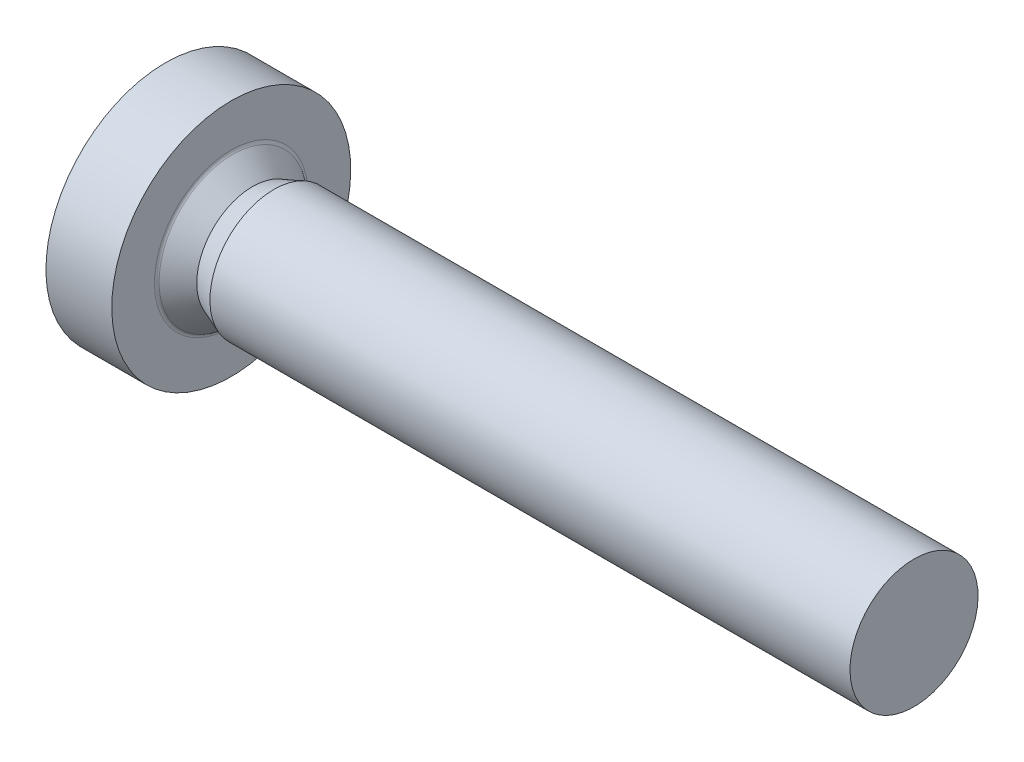
ISO-10303-21;
HEADER;
FILE_DESCRIPTION(('STEP AP214'),'2;1');
FILE_NAME('part.step','',(''),(''),'','','');
FILE_SCHEMA(('AUTOMOTIVE_DESIGN { 1 0 10303 214 1 1 1 1 }'));
ENDSEC;
DATA;
#1=APPLICATION_CONTEXT('core data for automotive mechanical design processes');
#2=APPLICATION_PROTOCOL_DEFINITION('international standard','automotive_design',2000,#1);
#3=PRODUCT_CONTEXT('',#1,'mechanical');
#4=PRODUCT('Part','Part','',(#3));
#5=PRODUCT_RELATED_PRODUCT_CATEGORY('part','',(#4));
#6=PRODUCT_DEFINITION_FORMATION('','',#4);
#7=PRODUCT_DEFINITION_CONTEXT('part definition',#1,'design');
#8=PRODUCT_DEFINITION('design','',#6,#7);
#9=PRODUCT_DEFINITION_SHAPE('','',#8);
#10=(LENGTH_UNIT() NAMED_UNIT(*) SI_UNIT(.MILLI.,.METRE.));
#11=(NAMED_UNIT(*) PLANE_ANGLE_UNIT() SI_UNIT($,.RADIAN.));
#12=(NAMED_UNIT(*) SI_UNIT($,.STERADIAN.) SOLID_ANGLE_UNIT());
#13=UNCERTAINTY_MEASURE_WITH_UNIT(LENGTH_MEASURE(1.E-05),#10,'distance_accuracy_value','');
#14=(GEOMETRIC_REPRESENTATION_CONTEXT(3) GLOBAL_UNCERTAINTY_ASSIGNED_CONTEXT((#13)) GLOBAL_UNIT_ASSIGNED_CONTEXT((#10,
#11,#12)) REPRESENTATION_CONTEXT('',''));
#15=CARTESIAN_POINT('',(0.,0.,0.));
#16=DIRECTION('',(0.,0.,1.));
#17=DIRECTION('',(1.,0.,0.));
#18=AXIS2_PLACEMENT_3D('',#15,#16,#17);
#19=CARTESIAN_POINT('',(16.,0.75,0.));
#20=DIRECTION('',(1.,0.,0.));
#21=DIRECTION('',(0.,1.,0.));
#22=AXIS2_PLACEMENT_3D('',#19,#20,#21);
#23=PLANE('',#22);
#24=CARTESIAN_POINT('',(16.,0.,0.));
#25=DIRECTION('',(1.,0.,0.));
#26=DIRECTION('',(0.,1.,0.));
#27=AXIS2_PLACEMENT_3D('',#24,#25,#26);
#28=CIRCLE('',#27,1.5);
#29=CARTESIAN_POINT('',(16.,1.5,0.));
#30=VERTEX_POINT('',#29);
#31=EDGE_CURVE('E11',#30,#30,#28,.T.);
#32=ORIENTED_EDGE('',*,*,#31,.T.);
#33=EDGE_LOOP('',(#32));
#34=FACE_BOUND('',#33,.T.);
#35=ADVANCED_FACE('F19',(#34),#23,.T.);
#36=CARTESIAN_POINT('',(8.5,0.,0.));
#37=DIRECTION('',(-1.,0.,0.));
#38=DIRECTION('',(0.,1.,0.));
#39=AXIS2_PLACEMENT_3D('',#36,#37,#38);
#40=CYLINDRICAL_SURFACE('',#39,1.5);
#41=CARTESIAN_POINT('',(1.,0.,0.));
#42=DIRECTION('',(1.,0.,0.));
#43=DIRECTION('',(0.,1.,0.));
#44=AXIS2_PLACEMENT_3D('',#41,#42,#43);
#45=CIRCLE('',#44,1.5);
#46=CARTESIAN_POINT('',(1.,1.5,0.));
#47=VERTEX_POINT('',#46);
#48=EDGE_CURVE('E29',#47,#47,#45,.T.);
#49=ORIENTED_EDGE('',*,*,#48,.T.);
#50=EDGE_LOOP('',(#49));
#51=FACE_BOUND('',#50,.T.);
#52=ORIENTED_EDGE('',*,*,#31,.F.);
#53=EDGE_LOOP('',(#52));
#54=FACE_BOUND('',#53,.T.);
#55=ADVANCED_FACE('F409',(#51,#54),#40,.T.);
#56=CARTESIAN_POINT('',(0.75,0.,0.));
#57=DIRECTION('',(1.,0.,0.));
#58=DIRECTION('',(0.,1.,0.));
#59=AXIS2_PLACEMENT_3D('',#56,#57,#58);
#60=CONICAL_SURFACE('',#59,1.404375,0.36532974538052);
#61=CARTESIAN_POINT('',(0.5,0.,0.));
#62=DIRECTION('',(1.,0.,0.));
#63=DIRECTION('',(0.,1.,0.));
#64=AXIS2_PLACEMENT_3D('',#61,#62,#63);
#65=CIRCLE('',#64,1.30875);
#66=CARTESIAN_POINT('',(0.5,1.30875,0.));
#67=VERTEX_POINT('',#66);
#68=EDGE_CURVE('E277',#67,#67,#65,.T.);
#69=ORIENTED_EDGE('',*,*,#68,.T.);
#70=EDGE_LOOP('',(#69));
#71=FACE_BOUND('',#70,.T.);
#72=ORIENTED_EDGE('',*,*,#48,.F.);
#73=EDGE_LOOP('',(#72));
#74=FACE_BOUND('',#73,.T.);
#75=ADVANCED_FACE('F414',(#71,#74),#60,.T.);
#76=CARTESIAN_POINT('',(0.266697090928547,0.,0.));
#77=DIRECTION('',(-1.,0.,0.));
#78=DIRECTION('',(0.,1.,0.));
#79=AXIS2_PLACEMENT_3D('',#76,#77,#78);
#80=CONICAL_SURFACE('',#79,1.51708001042528,0.728911585355214);
#81=CARTESIAN_POINT('',(0.0333941818570946,0.,0.));
#82=DIRECTION('',(1.,0.,0.));
#83=DIRECTION('',(0.,1.,0.));
#84=AXIS2_PLACEMENT_3D('',#81,#82,#83);
#85=CIRCLE('',#84,1.72541002085056);
#86=CARTESIAN_POINT('',(0.0333941818570951,1.72541002085056,0.));
#87=VERTEX_POINT('',#86);
#88=EDGE_CURVE('E275',#87,#87,#85,.T.);
#89=ORIENTED_EDGE('',*,*,#88,.T.);
#90=EDGE_LOOP('',(#89));
#91=FACE_BOUND('',#90,.T.);
#92=ORIENTED_EDGE('',*,*,#68,.F.);
#93=EDGE_LOOP('',(#92));
#94=FACE_BOUND('',#93,.T.);
#95=ADVANCED_FACE('F469',(#91,#94),#80,.T.);
#96=CARTESIAN_POINT('',(0.1,0.,0.));
#97=DIRECTION('',(1.,0.,0.));
#98=DIRECTION('',(0.,0.,-1.));
#99=AXIS2_PLACEMENT_3D('',#96,#97,#98);
#100=TOROIDAL_SURFACE('',#99,1.8,0.1);
#101=CARTESIAN_POINT('',(0.,0.,0.));
#102=DIRECTION('',(1.,0.,0.));
#103=DIRECTION('',(0.,1.,0.));
#104=AXIS2_PLACEMENT_3D('',#101,#102,#103);
#105=CIRCLE('',#104,1.8);
#106=CARTESIAN_POINT('',(0.,1.8,0.));
#107=VERTEX_POINT('',#106);
#108=EDGE_CURVE('E278',#107,#107,#105,.T.);
#109=ORIENTED_EDGE('',*,*,#108,.T.);
#110=EDGE_LOOP('',(#109));
#111=FACE_BOUND('',#110,.T.);
#112=ORIENTED_EDGE('',*,*,#88,.F.);
#113=EDGE_LOOP('',(#112));
#114=FACE_BOUND('',#113,.T.);
#115=ADVANCED_FACE('F446',(#111,#114),#100,.F.);
#116=CARTESIAN_POINT('',(0.,2.3,0.));
#117=DIRECTION('',(1.,0.,0.));
#118=DIRECTION('',(0.,1.,0.));
#119=AXIS2_PLACEMENT_3D('',#116,#117,#118);
#120=PLANE('',#119);
#121=CARTESIAN_POINT('',(0.,0.,0.));
#122=DIRECTION('',(1.,0.,0.));
#123=DIRECTION('',(0.,1.,0.));
#124=AXIS2_PLACEMENT_3D('',#121,#122,#123);
#125=CIRCLE('',#124,2.8);
#126=CARTESIAN_POINT('',(0.,2.8,0.));
#127=VERTEX_POINT('',#126);
#128=EDGE_CURVE('E286',#127,#127,#125,.T.);
#129=ORIENTED_EDGE('',*,*,#128,.T.);
#130=EDGE_LOOP('',(#129));
#131=FACE_BOUND('',#130,.T.);
#132=ORIENTED_EDGE('',*,*,#108,.F.);
#133=EDGE_LOOP('',(#132));
#134=FACE_BOUND('',#133,.T.);
#135=ADVANCED_FACE('F443',(#131,#134),#120,.T.);
#136=CARTESIAN_POINT('',(-0.771231517720798,0.,0.));
#137=DIRECTION('',(-1.,0.,0.));
#138=DIRECTION('',(0.,1.,0.));
#139=AXIS2_PLACEMENT_3D('',#136,#137,#138);
#140=CYLINDRICAL_SURFACE('',#139,2.8);
#141=CARTESIAN_POINT('',(-1.54246303544159,0.,0.));
#142=DIRECTION('',(1.,0.,0.));
#143=DIRECTION('',(0.,1.,0.));
#144=AXIS2_PLACEMENT_3D('',#141,#142,#143);
#145=CIRCLE('',#144,2.8);
#146=CARTESIAN_POINT('',(-1.54246303544159,2.8,0.));
#147=VERTEX_POINT('',#146);
#148=EDGE_CURVE('E284',#147,#147,#145,.T.);
#149=ORIENTED_EDGE('',*,*,#148,.T.);
#150=EDGE_LOOP('',(#149));
#151=FACE_BOUND('',#150,.T.);
#152=ORIENTED_EDGE('',*,*,#128,.F.);
#153=EDGE_LOOP('',(#152));
#154=FACE_BOUND('',#153,.T.);
#155=ADVANCED_FACE('F435',(#151,#154),#140,.T.);
#156=CARTESIAN_POINT('',(2.6,0.,0.));
#157=DIRECTION('',(0.,0.,1.));
#158=DIRECTION('',(1.,0.,0.));
#159=AXIS2_PLACEMENT_3D('',#156,#157,#158);
#160=SPHERICAL_SURFACE('',#159,5.);
#161=ORIENTED_EDGE('',*,*,#148,.F.);
#162=EDGE_LOOP('',(#161));
#163=FACE_BOUND('',#162,.T.);
#164=CARTESIAN_POINT('',(2.6,1.5,0.));
#165=DIRECTION('',(0.,1.,0.));
#166=DIRECTION('',(0.,0.,-1.));
#167=AXIS2_PLACEMENT_3D('',#164,#165,#166);
#168=CIRCLE('',#167,4.76969600708473);
#169=CARTESIAN_POINT('',(-2.16025209416476,1.5,-0.3));
#170=VERTEX_POINT('',#169);
#171=CARTESIAN_POINT('',(-2.16025209416476,1.5,0.3));
#172=VERTEX_POINT('',#171);
#173=EDGE_CURVE('E312',#170,#172,#168,.T.);
#174=ORIENTED_EDGE('',*,*,#173,.T.);
#175=CARTESIAN_POINT('',(2.6,-0.0146530414091956,0.167485029701634));
#176=DIRECTION('',(0.,-0.0871557427476582,0.996194698091746));
#177=DIRECTION('',(0.,0.996194698091746,0.0871557427476581));
#178=AXIS2_PLACEMENT_3D('',#175,#176,#177);
#179=CIRCLE('',#178,4.99717260590459);
#180=CARTESIAN_POINT('',(-2.35893576512593,0.6,0.221260202826669));
#181=VERTEX_POINT('',#180);
#182=EDGE_CURVE('E95',#172,#181,#179,.T.);
#183=ORIENTED_EDGE('',*,*,#182,.T.);
#184=CARTESIAN_POINT('',(2.6,0.245808478247197,0.425752773255334));
#185=DIRECTION('',(0.,0.5,0.866025403784438));
#186=DIRECTION('',(0.,0.866025403784438,-0.5));
#187=AXIS2_PLACEMENT_3D('',#184,#185,#186);
#188=CIRCLE('',#187,4.97577258002083);
#189=CARTESIAN_POINT('',(-2.374028589137,0.359888590016273,0.359888590016274));
#190=VERTEX_POINT('',#189);
#191=EDGE_CURVE('E281',#181,#190,#188,.T.);
#192=ORIENTED_EDGE('',*,*,#191,.T.);
#193=CARTESIAN_POINT('',(2.6,0.425752773255333,0.245808478247197));
#194=DIRECTION('',(0.,0.866025403784439,0.5));
#195=DIRECTION('',(0.,0.5,-0.866025403784439));
#196=AXIS2_PLACEMENT_3D('',#193,#194,#195);
#197=CIRCLE('',#196,4.97577258002083);
#198=CARTESIAN_POINT('',(-2.35893576512593,0.221260202826669,0.6));
#199=VERTEX_POINT('',#198);
#200=EDGE_CURVE('E200',#190,#199,#197,.T.);
#201=ORIENTED_EDGE('',*,*,#200,.T.);
#202=CARTESIAN_POINT('',(2.6,0.167485029701634,-0.0146530414091956));
#203=DIRECTION('',(0.,0.996194698091746,-0.0871557427476583));
#204=DIRECTION('',(0.,-0.0871557427476583,-0.996194698091746));
#205=AXIS2_PLACEMENT_3D('',#202,#203,#204);
#206=CIRCLE('',#205,4.99717260590459);
#207=CARTESIAN_POINT('',(-2.16025209416476,0.3,1.5));
#208=VERTEX_POINT('',#207);
#209=EDGE_CURVE('E206',#199,#208,#206,.T.);
#210=ORIENTED_EDGE('',*,*,#209,.T.);
#211=CARTESIAN_POINT('',(2.6,0.,1.5));
#212=DIRECTION('',(0.,0.,1.));
#213=DIRECTION('',(0.,1.,0.));
#214=AXIS2_PLACEMENT_3D('',#211,#212,#213);
#215=CIRCLE('',#214,4.76969600708473);
#216=CARTESIAN_POINT('',(-2.16025209416476,-0.3,1.5));
#217=VERTEX_POINT('',#216);
#218=EDGE_CURVE('E209',#208,#217,#215,.T.);
#219=ORIENTED_EDGE('',*,*,#218,.T.);
#220=CARTESIAN_POINT('',(2.6,-0.167485029701634,-0.0146530414091956));
#221=DIRECTION('',(0.,-0.996194698091746,-0.0871557427476581));
#222=DIRECTION('',(0.,-0.0871557427476581,0.996194698091746));
#223=AXIS2_PLACEMENT_3D('',#220,#221,#222);
#224=CIRCLE('',#223,4.99717260590459);
#225=CARTESIAN_POINT('',(-2.35893576512593,-0.221260202826669,0.6));
#226=VERTEX_POINT('',#225);
#227=EDGE_CURVE('E142',#217,#226,#224,.T.);
#228=ORIENTED_EDGE('',*,*,#227,.T.);
#229=CARTESIAN_POINT('',(2.6,-0.425752773255333,0.245808478247197));
#230=DIRECTION('',(0.,-0.866025403784439,0.5));
#231=DIRECTION('',(0.,0.5,0.866025403784439));
#232=AXIS2_PLACEMENT_3D('',#229,#230,#231);
#233=CIRCLE('',#232,4.97577258002083);
#234=CARTESIAN_POINT('',(-2.374028589137,-0.359888590016273,0.359888590016274));
#235=VERTEX_POINT('',#234);
#236=EDGE_CURVE('E258',#226,#235,#233,.T.);
#237=ORIENTED_EDGE('',*,*,#236,.T.);
#238=CARTESIAN_POINT('',(2.6,-0.245808478247197,0.425752773255334));
#239=DIRECTION('',(0.,-0.5,0.866025403784439));
#240=DIRECTION('',(0.,0.866025403784439,0.5));
#241=AXIS2_PLACEMENT_3D('',#238,#239,#240);
#242=CIRCLE('',#241,4.97577258002083);
#243=CARTESIAN_POINT('',(-2.35893576512593,-0.6,0.221260202826669));
#244=VERTEX_POINT('',#243);
#245=EDGE_CURVE('E254',#235,#244,#242,.T.);
#246=ORIENTED_EDGE('',*,*,#245,.T.);
#247=CARTESIAN_POINT('',(2.6,0.0146530414091956,0.167485029701634));
#248=DIRECTION('',(0.,0.0871557427476581,0.996194698091746));
#249=DIRECTION('',(0.,0.996194698091746,-0.0871557427476581));
#250=AXIS2_PLACEMENT_3D('',#247,#248,#249);
#251=CIRCLE('',#250,4.99717260590459);
#252=CARTESIAN_POINT('',(-2.16025209416476,-1.5,0.3));
#253=VERTEX_POINT('',#252);
#254=EDGE_CURVE('E266',#244,#253,#251,.T.);
#255=ORIENTED_EDGE('',*,*,#254,.T.);
#256=CARTESIAN_POINT('',(2.6,-1.5,0.));
#257=DIRECTION('',(0.,-1.,0.));
#258=DIRECTION('',(0.,0.,1.));
#259=AXIS2_PLACEMENT_3D('',#256,#257,#258);
#260=CIRCLE('',#259,4.76969600708473);
#261=CARTESIAN_POINT('',(-2.16025209416476,-1.5,-0.3));
#262=VERTEX_POINT('',#261);
#263=EDGE_CURVE('E330',#253,#262,#260,.T.);
#264=ORIENTED_EDGE('',*,*,#263,.T.);
#265=CARTESIAN_POINT('',(2.6,0.0146530414091956,-0.167485029701634));
#266=DIRECTION('',(0.,0.087155742747658,-0.996194698091746));
#267=DIRECTION('',(0.,-0.996194698091746,-0.087155742747658));
#268=AXIS2_PLACEMENT_3D('',#265,#266,#267);
#269=CIRCLE('',#268,4.99717260590459);
#270=CARTESIAN_POINT('',(-2.35893576512593,-0.6,-0.221260202826669));
#271=VERTEX_POINT('',#270);
#272=EDGE_CURVE('E263',#262,#271,#269,.T.);
#273=ORIENTED_EDGE('',*,*,#272,.T.);
#274=CARTESIAN_POINT('',(2.6,-0.245808478247196,-0.425752773255333));
#275=DIRECTION('',(0.,-0.5,-0.866025403784439));
#276=DIRECTION('',(0.,-0.866025403784439,0.5));
#277=AXIS2_PLACEMENT_3D('',#274,#275,#276);
#278=CIRCLE('',#277,4.97577258002083);
#279=CARTESIAN_POINT('',(-2.374028589137,-0.359888590016273,-0.359888590016273));
#280=VERTEX_POINT('',#279);
#281=EDGE_CURVE('E216',#271,#280,#278,.T.);
#282=ORIENTED_EDGE('',*,*,#281,.T.);
#283=CARTESIAN_POINT('',(2.6,-0.425752773255333,-0.245808478247196));
#284=DIRECTION('',(0.,-0.866025403784439,-0.5));
#285=DIRECTION('',(0.,-0.5,0.866025403784439));
#286=AXIS2_PLACEMENT_3D('',#283,#284,#285);
#287=CIRCLE('',#286,4.97577258002083);
#288=CARTESIAN_POINT('',(-2.35893576512593,-0.221260202826669,-0.6));
#289=VERTEX_POINT('',#288);
#290=EDGE_CURVE('E315',#280,#289,#287,.T.);
#291=ORIENTED_EDGE('',*,*,#290,.T.);
#292=CARTESIAN_POINT('',(2.6,-0.167485029701634,0.0146530414091956));
#293=DIRECTION('',(0.,-0.996194698091746,0.0871557427476582));
#294=DIRECTION('',(0.,0.0871557427476582,0.996194698091746));
#295=AXIS2_PLACEMENT_3D('',#292,#293,#294);
#296=CIRCLE('',#295,4.99717260590459);
#297=CARTESIAN_POINT('',(-2.16025209416476,-0.3,-1.5));
#298=VERTEX_POINT('',#297);
#299=EDGE_CURVE('E291',#289,#298,#296,.T.);
#300=ORIENTED_EDGE('',*,*,#299,.T.);
#301=CARTESIAN_POINT('',(2.6,0.,-1.5));
#302=DIRECTION('',(0.,0.,-1.));
#303=DIRECTION('',(0.,-1.,0.));
#304=AXIS2_PLACEMENT_3D('',#301,#302,#303);
#305=CIRCLE('',#304,4.76969600708473);
#306=CARTESIAN_POINT('',(-2.16025209416476,0.3,-1.5));
#307=VERTEX_POINT('',#306);
#308=EDGE_CURVE('E333',#298,#307,#305,.T.);
#309=ORIENTED_EDGE('',*,*,#308,.T.);
#310=CARTESIAN_POINT('',(2.6,0.167485029701634,0.0146530414091956));
#311=DIRECTION('',(0.,0.996194698091746,0.0871557427476582));
#312=DIRECTION('',(0.,0.0871557427476582,-0.996194698091746));
#313=AXIS2_PLACEMENT_3D('',#310,#311,#312);
#314=CIRCLE('',#313,4.99717260590459);
#315=CARTESIAN_POINT('',(-2.35893576512593,0.221260202826669,-0.6));
#316=VERTEX_POINT('',#315);
#317=EDGE_CURVE('E221',#307,#316,#314,.T.);
#318=ORIENTED_EDGE('',*,*,#317,.T.);
#319=CARTESIAN_POINT('',(2.6,0.425752773255333,-0.245808478247196));
#320=DIRECTION('',(0.,0.866025403784439,-0.5));
#321=DIRECTION('',(0.,-0.5,-0.866025403784439));
#322=AXIS2_PLACEMENT_3D('',#319,#320,#321);
#323=CIRCLE('',#322,4.97577258002083);
#324=CARTESIAN_POINT('',(-2.374028589137,0.359888590016273,-0.359888590016274));
#325=VERTEX_POINT('',#324);
#326=EDGE_CURVE('E67',#316,#325,#323,.T.);
#327=ORIENTED_EDGE('',*,*,#326,.T.);
#328=CARTESIAN_POINT('',(2.6,0.245808478247196,-0.425752773255333));
#329=DIRECTION('',(0.,0.5,-0.866025403784439));
#330=DIRECTION('',(0.,-0.866025403784439,-0.5));
#331=AXIS2_PLACEMENT_3D('',#328,#329,#330);
#332=CIRCLE('',#331,4.97577258002083);
#333=CARTESIAN_POINT('',(-2.35893576512593,0.6,-0.221260202826669));
#334=VERTEX_POINT('',#333);
#335=EDGE_CURVE('E240',#325,#334,#332,.T.);
#336=ORIENTED_EDGE('',*,*,#335,.T.);
#337=CARTESIAN_POINT('',(2.6,-0.0146530414091956,-0.167485029701633));
#338=DIRECTION('',(0.,-0.0871557427476582,-0.996194698091746));
#339=DIRECTION('',(0.,-0.996194698091746,0.0871557427476582));
#340=AXIS2_PLACEMENT_3D('',#337,#338,#339);
#341=CIRCLE('',#340,4.99717260590459);
#342=EDGE_CURVE('E225',#334,#170,#341,.T.);
#343=ORIENTED_EDGE('',*,*,#342,.T.);
#344=EDGE_LOOP('',(#174,#183,#192,#201,#210,#219,#228,#237,#246,#255,#264,#273,#282,#291,#300,
#309,#318,#327,#336,#343));
#345=FACE_BOUND('',#344,.T.);
#346=ADVANCED_FACE('F393',(#163,#345),#160,.T.);
#347=CARTESIAN_POINT('',(-1.2,0.,0.));
#348=DIRECTION('',(1.,0.,0.));
#349=DIRECTION('',(0.,0.,-1.));
#350=AXIS2_PLACEMENT_3D('',#347,#348,#349);
#351=PLANE('',#350);
#352=DIRECTION('',(0.,0.,-1.));
#353=VECTOR('',#352,1.);
#354=CARTESIAN_POINT('',(-1.2,1.5,-0.3));
#355=LINE('',#354,#353);
#356=CARTESIAN_POINT('',(-1.2,1.5,0.3));
#357=VERTEX_POINT('',#356);
#358=CARTESIAN_POINT('',(-1.2,1.5,-0.3));
#359=VERTEX_POINT('',#358);
#360=EDGE_CURVE('E297',#357,#359,#355,.T.);
#361=ORIENTED_EDGE('',*,*,#360,.T.);
#362=DIRECTION('',(0.,-0.996194698091746,0.0871557427476582));
#363=VECTOR('',#362,1.);
#364=CARTESIAN_POINT('',(-1.2,1.5,-0.3));
#365=LINE('',#364,#363);
#366=CARTESIAN_POINT('',(-1.2,0.6,-0.221260202826669));
#367=VERTEX_POINT('',#366);
#368=EDGE_CURVE('E227',#359,#367,#365,.T.);
#369=ORIENTED_EDGE('',*,*,#368,.T.);
#370=DIRECTION('',(0.,-0.866025403784439,-0.5));
#371=VECTOR('',#370,1.);
#372=CARTESIAN_POINT('',(-1.2,0.6,-0.221260202826669));
#373=LINE('',#372,#371);
#374=CARTESIAN_POINT('',(-1.2,0.359888590016273,-0.359888590016273));
#375=VERTEX_POINT('',#374);
#376=EDGE_CURVE('E234',#367,#375,#373,.T.);
#377=ORIENTED_EDGE('',*,*,#376,.T.);
#378=DIRECTION('',(0.,-0.5,-0.866025403784439));
#379=VECTOR('',#378,1.);
#380=CARTESIAN_POINT('',(-1.2,0.221260202826669,-0.6));
#381=LINE('',#380,#379);
#382=CARTESIAN_POINT('',(-1.2,0.221260202826669,-0.6));
#383=VERTEX_POINT('',#382);
#384=EDGE_CURVE('E57',#375,#383,#381,.T.);
#385=ORIENTED_EDGE('',*,*,#384,.T.);
#386=DIRECTION('',(0.,0.0871557427476582,-0.996194698091746));
#387=VECTOR('',#386,1.);
#388=CARTESIAN_POINT('',(-1.2,0.3,-1.5));
#389=LINE('',#388,#387);
#390=CARTESIAN_POINT('',(-1.2,0.3,-1.5));
#391=VERTEX_POINT('',#390);
#392=EDGE_CURVE('E73',#383,#391,#389,.T.);
#393=ORIENTED_EDGE('',*,*,#392,.T.);
#394=DIRECTION('',(0.,-1.,0.));
#395=VECTOR('',#394,1.);
#396=CARTESIAN_POINT('',(-1.2,-0.3,-1.5));
#397=LINE('',#396,#395);
#398=CARTESIAN_POINT('',(-1.2,-0.3,-1.5));
#399=VERTEX_POINT('',#398);
#400=EDGE_CURVE('E279',#391,#399,#397,.T.);
#401=ORIENTED_EDGE('',*,*,#400,.T.);
#402=DIRECTION('',(0.,0.0871557427476582,0.996194698091746));
#403=VECTOR('',#402,1.);
#404=CARTESIAN_POINT('',(-1.2,-0.3,-1.5));
#405=LINE('',#404,#403);
#406=CARTESIAN_POINT('',(-1.2,-0.221260202826669,-0.6));
#407=VERTEX_POINT('',#406);
#408=EDGE_CURVE('E294',#399,#407,#405,.T.);
#409=ORIENTED_EDGE('',*,*,#408,.T.);
#410=DIRECTION('',(0.,-0.5,0.866025403784439));
#411=VECTOR('',#410,1.);
#412=CARTESIAN_POINT('',(-1.2,-0.221260202826669,-0.6));
#413=LINE('',#412,#411);
#414=CARTESIAN_POINT('',(-1.2,-0.359888590016273,-0.359888590016273));
#415=VERTEX_POINT('',#414);
#416=EDGE_CURVE('E317',#407,#415,#413,.T.);
#417=ORIENTED_EDGE('',*,*,#416,.T.);
#418=DIRECTION('',(0.,-0.866025403784439,0.5));
#419=VECTOR('',#418,1.);
#420=CARTESIAN_POINT('',(-1.2,-0.6,-0.221260202826669));
#421=LINE('',#420,#419);
#422=CARTESIAN_POINT('',(-1.2,-0.6,-0.221260202826669));
#423=VERTEX_POINT('',#422);
#424=EDGE_CURVE('E219',#415,#423,#421,.T.);
#425=ORIENTED_EDGE('',*,*,#424,.T.);
#426=DIRECTION('',(0.,-0.996194698091746,-0.087155742747658));
#427=VECTOR('',#426,1.);
#428=CARTESIAN_POINT('',(-1.2,-1.5,-0.3));
#429=LINE('',#428,#427);
#430=CARTESIAN_POINT('',(-1.2,-1.5,-0.3));
#431=VERTEX_POINT('',#430);
#432=EDGE_CURVE('E342',#423,#431,#429,.T.);
#433=ORIENTED_EDGE('',*,*,#432,.T.);
#434=DIRECTION('',(0.,0.,1.));
#435=VECTOR('',#434,1.);
#436=CARTESIAN_POINT('',(-1.2,-1.5,0.3));
#437=LINE('',#436,#435);
#438=CARTESIAN_POINT('',(-1.2,-1.5,0.3));
#439=VERTEX_POINT('',#438);
#440=EDGE_CURVE('E264',#431,#439,#437,.T.);
#441=ORIENTED_EDGE('',*,*,#440,.T.);
#442=DIRECTION('',(0.,0.996194698091746,-0.0871557427476581));
#443=VECTOR('',#442,1.);
#444=CARTESIAN_POINT('',(-1.2,-1.5,0.3));
#445=LINE('',#444,#443);
#446=CARTESIAN_POINT('',(-1.2,-0.6,0.221260202826669));
#447=VERTEX_POINT('',#446);
#448=EDGE_CURVE('E214',#439,#447,#445,.T.);
#449=ORIENTED_EDGE('',*,*,#448,.T.);
#450=DIRECTION('',(0.,0.866025403784439,0.5));
#451=VECTOR('',#450,1.);
#452=CARTESIAN_POINT('',(-1.2,-0.6,0.221260202826669));
#453=LINE('',#452,#451);
#454=CARTESIAN_POINT('',(-1.2,-0.359888590016273,0.359888590016274));
#455=VERTEX_POINT('',#454);
#456=EDGE_CURVE('E253',#447,#455,#453,.T.);
#457=ORIENTED_EDGE('',*,*,#456,.T.);
#458=DIRECTION('',(0.,0.5,0.866025403784439));
#459=VECTOR('',#458,1.);
#460=CARTESIAN_POINT('',(-1.2,-0.221260202826669,0.6));
#461=LINE('',#460,#459);
#462=CARTESIAN_POINT('',(-1.2,-0.221260202826669,0.6));
#463=VERTEX_POINT('',#462);
#464=EDGE_CURVE('E274',#455,#463,#461,.T.);
#465=ORIENTED_EDGE('',*,*,#464,.T.);
#466=DIRECTION('',(0.,-0.0871557427476581,0.996194698091746));
#467=VECTOR('',#466,1.);
#468=CARTESIAN_POINT('',(-1.2,-0.3,1.5));
#469=LINE('',#468,#467);
#470=CARTESIAN_POINT('',(-1.2,-0.3,1.5));
#471=VERTEX_POINT('',#470);
#472=EDGE_CURVE('E137',#463,#471,#469,.T.);
#473=ORIENTED_EDGE('',*,*,#472,.T.);
#474=DIRECTION('',(0.,1.,0.));
#475=VECTOR('',#474,1.);
#476=CARTESIAN_POINT('',(-1.2,0.3,1.5));
#477=LINE('',#476,#475);
#478=CARTESIAN_POINT('',(-1.2,0.3,1.5));
#479=VERTEX_POINT('',#478);
#480=EDGE_CURVE('E202',#471,#479,#477,.T.);
#481=ORIENTED_EDGE('',*,*,#480,.T.);
#482=DIRECTION('',(0.,-0.0871557427476583,-0.996194698091746));
#483=VECTOR('',#482,1.);
#484=CARTESIAN_POINT('',(-1.2,0.3,1.5));
#485=LINE('',#484,#483);
#486=CARTESIAN_POINT('',(-1.2,0.221260202826669,0.6));
#487=VERTEX_POINT('',#486);
#488=EDGE_CURVE('E190',#479,#487,#485,.T.);
#489=ORIENTED_EDGE('',*,*,#488,.T.);
#490=DIRECTION('',(0.,0.5,-0.866025403784439));
#491=VECTOR('',#490,1.);
#492=CARTESIAN_POINT('',(-1.2,0.221260202826669,0.6));
#493=LINE('',#492,#491);
#494=CARTESIAN_POINT('',(-1.2,0.359888590016273,0.359888590016274));
#495=VERTEX_POINT('',#494);
#496=EDGE_CURVE('E249',#487,#495,#493,.T.);
#497=ORIENTED_EDGE('',*,*,#496,.T.);
#498=DIRECTION('',(0.,0.866025403784438,-0.5));
#499=VECTOR('',#498,1.);
#500=CARTESIAN_POINT('',(-1.2,0.6,0.221260202826669));
#501=LINE('',#500,#499);
#502=CARTESIAN_POINT('',(-1.2,0.6,0.221260202826669));
#503=VERTEX_POINT('',#502);
#504=EDGE_CURVE('E309',#495,#503,#501,.T.);
#505=ORIENTED_EDGE('',*,*,#504,.T.);
#506=DIRECTION('',(0.,0.996194698091746,0.0871557427476582));
#507=VECTOR('',#506,1.);
#508=CARTESIAN_POINT('',(-1.2,1.5,0.3));
#509=LINE('',#508,#507);
#510=EDGE_CURVE('E102',#503,#357,#509,.T.);
#511=ORIENTED_EDGE('',*,*,#510,.T.);
#512=EDGE_LOOP('',(#361,#369,#377,#385,#393,#401,#409,#417,#425,#433,#441,#449,#457,#465,#473,
#481,#489,#497,#505,#511));
#513=FACE_BOUND('',#512,.T.);
#514=ADVANCED_FACE('F203',(#513),#351,.F.);
#515=CARTESIAN_POINT('',(-2.64,1.05,0.260630101413334));
#516=DIRECTION('',(0.,-0.0871557427476581,0.996194698091746));
#517=DIRECTION('',(0.,-0.996194698091746,-0.0871557427476582));
#518=AXIS2_PLACEMENT_3D('',#515,#516,#517);
#519=PLANE('',#518);
#520=ORIENTED_EDGE('',*,*,#182,.F.);
#521=DIRECTION('',(1.,0.,0.));
#522=VECTOR('',#521,1.);
#523=CARTESIAN_POINT('',(-2.64,1.5,0.3));
#524=LINE('',#523,#522);
#525=EDGE_CURVE('E270',#172,#357,#524,.T.);
#526=ORIENTED_EDGE('',*,*,#525,.T.);
#527=ORIENTED_EDGE('',*,*,#510,.F.);
#528=DIRECTION('',(1.,0.,0.));
#529=VECTOR('',#528,1.);
#530=CARTESIAN_POINT('',(-2.64,0.6,0.221260202826669));
#531=LINE('',#530,#529);
#532=EDGE_CURVE('E283',#181,#503,#531,.T.);
#533=ORIENTED_EDGE('',*,*,#532,.F.);
#534=EDGE_LOOP('',(#520,#526,#527,#533));
#535=FACE_BOUND('',#534,.T.);
#536=ADVANCED_FACE('F422',(#535),#519,.F.);
#537=CARTESIAN_POINT('',(-2.64,0.479944295008137,0.290574396421471));
#538=DIRECTION('',(0.,0.5,0.866025403784438));
#539=DIRECTION('',(0.,-0.866025403784438,0.5));
#540=AXIS2_PLACEMENT_3D('',#537,#538,#539);
#541=PLANE('',#540);
#542=ORIENTED_EDGE('',*,*,#191,.F.);
#543=ORIENTED_EDGE('',*,*,#532,.T.);
#544=ORIENTED_EDGE('',*,*,#504,.F.);
#545=DIRECTION('',(1.,0.,0.));
#546=VECTOR('',#545,1.);
#547=CARTESIAN_POINT('',(-2.64,0.359888590016273,0.359888590016273));
#548=LINE('',#547,#546);
#549=EDGE_CURVE('E246',#190,#495,#548,.T.);
#550=ORIENTED_EDGE('',*,*,#549,.F.);
#551=EDGE_LOOP('',(#542,#543,#544,#550));
#552=FACE_BOUND('',#551,.T.);
#553=ADVANCED_FACE('F21',(#552),#541,.F.);
#554=CARTESIAN_POINT('',(-2.64,0.290574396421471,0.479944295008137));
#555=DIRECTION('',(0.,0.866025403784439,0.5));
#556=DIRECTION('',(0.,-0.5,0.866025403784439));
#557=AXIS2_PLACEMENT_3D('',#554,#555,#556);
#558=PLANE('',#557);
#559=ORIENTED_EDGE('',*,*,#200,.F.);
#560=ORIENTED_EDGE('',*,*,#549,.T.);
#561=ORIENTED_EDGE('',*,*,#496,.F.);
#562=DIRECTION('',(1.,0.,0.));
#563=VECTOR('',#562,1.);
#564=CARTESIAN_POINT('',(-2.64,0.221260202826669,0.6));
#565=LINE('',#564,#563);
#566=EDGE_CURVE('E198',#199,#487,#565,.T.);
#567=ORIENTED_EDGE('',*,*,#566,.F.);
#568=EDGE_LOOP('',(#559,#560,#561,#567));
#569=FACE_BOUND('',#568,.T.);
#570=ADVANCED_FACE('F421',(#569),#558,.F.);
#571=CARTESIAN_POINT('',(-2.64,0.260630101413335,1.05));
#572=DIRECTION('',(0.,0.996194698091746,-0.0871557427476583));
#573=DIRECTION('',(0.,0.0871557427476583,0.996194698091746));
#574=AXIS2_PLACEMENT_3D('',#571,#572,#573);
#575=PLANE('',#574);
#576=ORIENTED_EDGE('',*,*,#209,.F.);
#577=ORIENTED_EDGE('',*,*,#566,.T.);
#578=ORIENTED_EDGE('',*,*,#488,.F.);
#579=DIRECTION('',(1.,0.,0.));
#580=VECTOR('',#579,1.);
#581=CARTESIAN_POINT('',(-2.64,0.3,1.5));
#582=LINE('',#581,#580);
#583=EDGE_CURVE('E195',#208,#479,#582,.T.);
#584=ORIENTED_EDGE('',*,*,#583,.F.);
#585=EDGE_LOOP('',(#576,#577,#578,#584));
#586=FACE_BOUND('',#585,.T.);
#587=ADVANCED_FACE('F193',(#586),#575,.F.);
#588=CARTESIAN_POINT('',(-2.64,0.,1.5));
#589=DIRECTION('',(0.,0.,1.));
#590=DIRECTION('',(0.,-1.,0.));
#591=AXIS2_PLACEMENT_3D('',#588,#589,#590);
#592=PLANE('',#591);
#593=ORIENTED_EDGE('',*,*,#218,.F.);
#594=ORIENTED_EDGE('',*,*,#583,.T.);
#595=ORIENTED_EDGE('',*,*,#480,.F.);
#596=DIRECTION('',(1.,0.,0.));
#597=VECTOR('',#596,1.);
#598=CARTESIAN_POINT('',(-2.64,-0.3,1.5));
#599=LINE('',#598,#597);
#600=EDGE_CURVE('E273',#217,#471,#599,.T.);
#601=ORIENTED_EDGE('',*,*,#600,.F.);
#602=EDGE_LOOP('',(#593,#594,#595,#601));
#603=FACE_BOUND('',#602,.T.);
#604=ADVANCED_FACE('F208',(#603),#592,.F.);
#605=CARTESIAN_POINT('',(-2.64,-0.260630101413334,1.05));
#606=DIRECTION('',(0.,-0.996194698091746,-0.0871557427476581));
#607=DIRECTION('',(0.,0.0871557427476581,-0.996194698091746));
#608=AXIS2_PLACEMENT_3D('',#605,#606,#607);
#609=PLANE('',#608);
#610=ORIENTED_EDGE('',*,*,#227,.F.);
#611=ORIENTED_EDGE('',*,*,#600,.T.);
#612=ORIENTED_EDGE('',*,*,#472,.F.);
#613=DIRECTION('',(1.,0.,0.));
#614=VECTOR('',#613,1.);
#615=CARTESIAN_POINT('',(-2.64,-0.221260202826669,0.6));
#616=LINE('',#615,#614);
#617=EDGE_CURVE('E244',#226,#463,#616,.T.);
#618=ORIENTED_EDGE('',*,*,#617,.F.);
#619=EDGE_LOOP('',(#610,#611,#612,#618));
#620=FACE_BOUND('',#619,.T.);
#621=ADVANCED_FACE('F425',(#620),#609,.F.);
#622=CARTESIAN_POINT('',(-2.64,-0.290574396421471,0.479944295008137));
#623=DIRECTION('',(0.,-0.866025403784439,0.5));
#624=DIRECTION('',(0.,-0.5,-0.866025403784439));
#625=AXIS2_PLACEMENT_3D('',#622,#623,#624);
#626=PLANE('',#625);
#627=ORIENTED_EDGE('',*,*,#236,.F.);
#628=ORIENTED_EDGE('',*,*,#617,.T.);
#629=ORIENTED_EDGE('',*,*,#464,.F.);
#630=DIRECTION('',(1.,0.,0.));
#631=VECTOR('',#630,1.);
#632=CARTESIAN_POINT('',(-2.64,-0.359888590016273,0.359888590016274));
#633=LINE('',#632,#631);
#634=EDGE_CURVE('E250',#235,#455,#633,.T.);
#635=ORIENTED_EDGE('',*,*,#634,.F.);
#636=EDGE_LOOP('',(#627,#628,#629,#635));
#637=FACE_BOUND('',#636,.T.);
#638=ADVANCED_FACE('F428',(#637),#626,.F.);
#639=CARTESIAN_POINT('',(-2.64,-0.479944295008137,0.290574396421471));
#640=DIRECTION('',(0.,-0.5,0.866025403784439));
#641=DIRECTION('',(0.,-0.866025403784439,-0.5));
#642=AXIS2_PLACEMENT_3D('',#639,#640,#641);
#643=PLANE('',#642);
#644=ORIENTED_EDGE('',*,*,#245,.F.);
#645=ORIENTED_EDGE('',*,*,#634,.T.);
#646=ORIENTED_EDGE('',*,*,#456,.F.);
#647=DIRECTION('',(1.,0.,0.));
#648=VECTOR('',#647,1.);
#649=CARTESIAN_POINT('',(-2.64,-0.6,0.221260202826669));
#650=LINE('',#649,#648);
#651=EDGE_CURVE('E269',#244,#447,#650,.T.);
#652=ORIENTED_EDGE('',*,*,#651,.F.);
#653=EDGE_LOOP('',(#644,#645,#646,#652));
#654=FACE_BOUND('',#653,.T.);
#655=ADVANCED_FACE('F432',(#654),#643,.F.);
#656=CARTESIAN_POINT('',(-2.64,-1.05,0.260630101413335));
#657=DIRECTION('',(0.,0.0871557427476581,0.996194698091746));
#658=DIRECTION('',(0.,-0.996194698091746,0.0871557427476581));
#659=AXIS2_PLACEMENT_3D('',#656,#657,#658);
#660=PLANE('',#659);
#661=ORIENTED_EDGE('',*,*,#254,.F.);
#662=ORIENTED_EDGE('',*,*,#651,.T.);
#663=ORIENTED_EDGE('',*,*,#448,.F.);
#664=DIRECTION('',(1.,0.,0.));
#665=VECTOR('',#664,1.);
#666=CARTESIAN_POINT('',(-2.64,-1.5,0.3));
#667=LINE('',#666,#665);
#668=EDGE_CURVE('E23',#253,#439,#667,.T.);
#669=ORIENTED_EDGE('',*,*,#668,.F.);
#670=EDGE_LOOP('',(#661,#662,#663,#669));
#671=FACE_BOUND('',#670,.T.);
#672=ADVANCED_FACE('F377',(#671),#660,.F.);
#673=CARTESIAN_POINT('',(-2.64,1.5,0.));
#674=DIRECTION('',(0.,1.,0.));
#675=DIRECTION('',(0.,0.,1.));
#676=AXIS2_PLACEMENT_3D('',#673,#674,#675);
#677=PLANE('',#676);
#678=ORIENTED_EDGE('',*,*,#173,.F.);
#679=DIRECTION('',(1.,0.,0.));
#680=VECTOR('',#679,1.);
#681=CARTESIAN_POINT('',(-2.64,1.5,-0.3));
#682=LINE('',#681,#680);
#683=EDGE_CURVE('E231',#170,#359,#682,.T.);
#684=ORIENTED_EDGE('',*,*,#683,.T.);
#685=ORIENTED_EDGE('',*,*,#360,.F.);
#686=ORIENTED_EDGE('',*,*,#525,.F.);
#687=EDGE_LOOP('',(#678,#684,#685,#686));
#688=FACE_BOUND('',#687,.T.);
#689=ADVANCED_FACE('F431',(#688),#677,.F.);
#690=CARTESIAN_POINT('',(-2.64,1.05,-0.260630101413335));
#691=DIRECTION('',(0.,-0.0871557427476582,-0.996194698091746));
#692=DIRECTION('',(0.,0.996194698091746,-0.0871557427476582));
#693=AXIS2_PLACEMENT_3D('',#690,#691,#692);
#694=PLANE('',#693);
#695=ORIENTED_EDGE('',*,*,#342,.F.);
#696=DIRECTION('',(1.,0.,0.));
#697=VECTOR('',#696,1.);
#698=CARTESIAN_POINT('',(-2.64,0.6,-0.221260202826669));
#699=LINE('',#698,#697);
#700=EDGE_CURVE('E228',#334,#367,#699,.T.);
#701=ORIENTED_EDGE('',*,*,#700,.T.);
#702=ORIENTED_EDGE('',*,*,#368,.F.);
#703=ORIENTED_EDGE('',*,*,#683,.F.);
#704=EDGE_LOOP('',(#695,#701,#702,#703));
#705=FACE_BOUND('',#704,.T.);
#706=ADVANCED_FACE('F440',(#705),#694,.F.);
#707=CARTESIAN_POINT('',(-2.64,0.479944295008137,-0.290574396421471));
#708=DIRECTION('',(0.,0.5,-0.866025403784439));
#709=DIRECTION('',(0.,0.866025403784439,0.5));
#710=AXIS2_PLACEMENT_3D('',#707,#708,#709);
#711=PLANE('',#710);
#712=ORIENTED_EDGE('',*,*,#335,.F.);
#713=DIRECTION('',(1.,0.,0.));
#714=VECTOR('',#713,1.);
#715=CARTESIAN_POINT('',(-2.64,0.359888590016273,-0.359888590016274));
#716=LINE('',#715,#714);
#717=EDGE_CURVE('E257',#325,#375,#716,.T.);
#718=ORIENTED_EDGE('',*,*,#717,.T.);
#719=ORIENTED_EDGE('',*,*,#376,.F.);
#720=ORIENTED_EDGE('',*,*,#700,.F.);
#721=EDGE_LOOP('',(#712,#718,#719,#720));
#722=FACE_BOUND('',#721,.T.);
#723=ADVANCED_FACE('F382',(#722),#711,.F.);
#724=CARTESIAN_POINT('',(-2.64,0.290574396421471,-0.479944295008137));
#725=DIRECTION('',(0.,0.866025403784439,-0.5));
#726=DIRECTION('',(0.,0.5,0.866025403784439));
#727=AXIS2_PLACEMENT_3D('',#724,#725,#726);
#728=PLANE('',#727);
#729=ORIENTED_EDGE('',*,*,#326,.F.);
#730=DIRECTION('',(1.,0.,0.));
#731=VECTOR('',#730,1.);
#732=CARTESIAN_POINT('',(-2.64,0.221260202826669,-0.6));
#733=LINE('',#732,#731);
#734=EDGE_CURVE('E289',#316,#383,#733,.T.);
#735=ORIENTED_EDGE('',*,*,#734,.T.);
#736=ORIENTED_EDGE('',*,*,#384,.F.);
#737=ORIENTED_EDGE('',*,*,#717,.F.);
#738=EDGE_LOOP('',(#729,#735,#736,#737));
#739=FACE_BOUND('',#738,.T.);
#740=ADVANCED_FACE('F383',(#739),#728,.F.);
#741=CARTESIAN_POINT('',(-2.64,0.260630101413335,-1.05));
#742=DIRECTION('',(0.,0.996194698091746,0.0871557427476582));
#743=DIRECTION('',(0.,-0.0871557427476582,0.996194698091746));
#744=AXIS2_PLACEMENT_3D('',#741,#742,#743);
#745=PLANE('',#744);
#746=ORIENTED_EDGE('',*,*,#317,.F.);
#747=DIRECTION('',(1.,0.,0.));
#748=VECTOR('',#747,1.);
#749=CARTESIAN_POINT('',(-2.64,0.3,-1.5));
#750=LINE('',#749,#748);
#751=EDGE_CURVE('E224',#307,#391,#750,.T.);
#752=ORIENTED_EDGE('',*,*,#751,.T.);
#753=ORIENTED_EDGE('',*,*,#392,.F.);
#754=ORIENTED_EDGE('',*,*,#734,.F.);
#755=EDGE_LOOP('',(#746,#752,#753,#754));
#756=FACE_BOUND('',#755,.T.);
#757=ADVANCED_FACE('F385',(#756),#745,.F.);
#758=CARTESIAN_POINT('',(-2.64,0.,-1.5));
#759=DIRECTION('',(0.,0.,-1.));
#760=DIRECTION('',(0.,1.,0.));
#761=AXIS2_PLACEMENT_3D('',#758,#759,#760);
#762=PLANE('',#761);
#763=ORIENTED_EDGE('',*,*,#308,.F.);
#764=DIRECTION('',(1.,0.,0.));
#765=VECTOR('',#764,1.);
#766=CARTESIAN_POINT('',(-2.64,-0.3,-1.5));
#767=LINE('',#766,#765);
#768=EDGE_CURVE('E336',#298,#399,#767,.T.);
#769=ORIENTED_EDGE('',*,*,#768,.T.);
#770=ORIENTED_EDGE('',*,*,#400,.F.);
#771=ORIENTED_EDGE('',*,*,#751,.F.);
#772=EDGE_LOOP('',(#763,#769,#770,#771));
#773=FACE_BOUND('',#772,.T.);
#774=ADVANCED_FACE('F390',(#773),#762,.F.);
#775=CARTESIAN_POINT('',(-2.64,-0.260630101413334,-1.05));
#776=DIRECTION('',(0.,-0.996194698091746,0.0871557427476582));
#777=DIRECTION('',(0.,-0.0871557427476582,-0.996194698091746));
#778=AXIS2_PLACEMENT_3D('',#775,#776,#777);
#779=PLANE('',#778);
#780=ORIENTED_EDGE('',*,*,#299,.F.);
#781=DIRECTION('',(1.,0.,0.));
#782=VECTOR('',#781,1.);
#783=CARTESIAN_POINT('',(-2.64,-0.221260202826669,-0.6));
#784=LINE('',#783,#782);
#785=EDGE_CURVE('E295',#289,#407,#784,.T.);
#786=ORIENTED_EDGE('',*,*,#785,.T.);
#787=ORIENTED_EDGE('',*,*,#408,.F.);
#788=ORIENTED_EDGE('',*,*,#768,.F.);
#789=EDGE_LOOP('',(#780,#786,#787,#788));
#790=FACE_BOUND('',#789,.T.);
#791=ADVANCED_FACE('F392',(#790),#779,.F.);
#792=CARTESIAN_POINT('',(-2.64,-0.290574396421471,-0.479944295008137));
#793=DIRECTION('',(0.,-0.866025403784439,-0.5));
#794=DIRECTION('',(0.,0.5,-0.866025403784439));
#795=AXIS2_PLACEMENT_3D('',#792,#793,#794);
#796=PLANE('',#795);
#797=ORIENTED_EDGE('',*,*,#290,.F.);
#798=DIRECTION('',(1.,0.,0.));
#799=VECTOR('',#798,1.);
#800=CARTESIAN_POINT('',(-2.64,-0.359888590016273,-0.359888590016273));
#801=LINE('',#800,#799);
#802=EDGE_CURVE('E318',#280,#415,#801,.T.);
#803=ORIENTED_EDGE('',*,*,#802,.T.);
#804=ORIENTED_EDGE('',*,*,#416,.F.);
#805=ORIENTED_EDGE('',*,*,#785,.F.);
#806=EDGE_LOOP('',(#797,#803,#804,#805));
#807=FACE_BOUND('',#806,.T.);
#808=ADVANCED_FACE('F396',(#807),#796,.F.);
#809=CARTESIAN_POINT('',(-2.64,-0.479944295008137,-0.290574396421471));
#810=DIRECTION('',(0.,-0.5,-0.866025403784439));
#811=DIRECTION('',(0.,0.866025403784439,-0.5));
#812=AXIS2_PLACEMENT_3D('',#809,#810,#811);
#813=PLANE('',#812);
#814=ORIENTED_EDGE('',*,*,#281,.F.);
#815=DIRECTION('',(1.,0.,0.));
#816=VECTOR('',#815,1.);
#817=CARTESIAN_POINT('',(-2.64,-0.6,-0.221260202826669));
#818=LINE('',#817,#816);
#819=EDGE_CURVE('E220',#271,#423,#818,.T.);
#820=ORIENTED_EDGE('',*,*,#819,.T.);
#821=ORIENTED_EDGE('',*,*,#424,.F.);
#822=ORIENTED_EDGE('',*,*,#802,.F.);
#823=EDGE_LOOP('',(#814,#820,#821,#822));
#824=FACE_BOUND('',#823,.T.);
#825=ADVANCED_FACE('F361',(#824),#813,.F.);
#826=CARTESIAN_POINT('',(-2.64,-1.05,-0.260630101413334));
#827=DIRECTION('',(0.,0.087155742747658,-0.996194698091746));
#828=DIRECTION('',(0.,0.996194698091746,0.087155742747658));
#829=AXIS2_PLACEMENT_3D('',#826,#827,#828);
#830=PLANE('',#829);
#831=ORIENTED_EDGE('',*,*,#272,.F.);
#832=DIRECTION('',(1.,0.,0.));
#833=VECTOR('',#832,1.);
#834=CARTESIAN_POINT('',(-2.64,-1.5,-0.3));
#835=LINE('',#834,#833);
#836=EDGE_CURVE('E260',#262,#431,#835,.T.);
#837=ORIENTED_EDGE('',*,*,#836,.T.);
#838=ORIENTED_EDGE('',*,*,#432,.F.);
#839=ORIENTED_EDGE('',*,*,#819,.F.);
#840=EDGE_LOOP('',(#831,#837,#838,#839));
#841=FACE_BOUND('',#840,.T.);
#842=ADVANCED_FACE('F366',(#841),#830,.F.);
#843=CARTESIAN_POINT('',(-2.64,-1.5,0.));
#844=DIRECTION('',(0.,-1.,0.));
#845=DIRECTION('',(0.,0.,-1.));
#846=AXIS2_PLACEMENT_3D('',#843,#844,#845);
#847=PLANE('',#846);
#848=ORIENTED_EDGE('',*,*,#263,.F.);
#849=ORIENTED_EDGE('',*,*,#668,.T.);
#850=ORIENTED_EDGE('',*,*,#440,.F.);
#851=ORIENTED_EDGE('',*,*,#836,.F.);
#852=EDGE_LOOP('',(#848,#849,#850,#851));
#853=FACE_BOUND('',#852,.T.);
#854=ADVANCED_FACE('F374',(#853),#847,.F.);
#855=CLOSED_SHELL('',(#35,#55,#75,#95,#115,#135,#155,#346,#514,#536,#553,#570,#587,#604,#621,
#638,#655,#672,#689,#706,#723,#740,#757,#774,#791,#808,#825,#842,#854));
#856=MANIFOLD_SOLID_BREP('B1',#855);
#857=ADVANCED_BREP_SHAPE_REPRESENTATION('',(#18,#856),#14);
#858=SHAPE_DEFINITION_REPRESENTATION(#9,#857);
ENDSEC;
END-ISO-10303-21;
